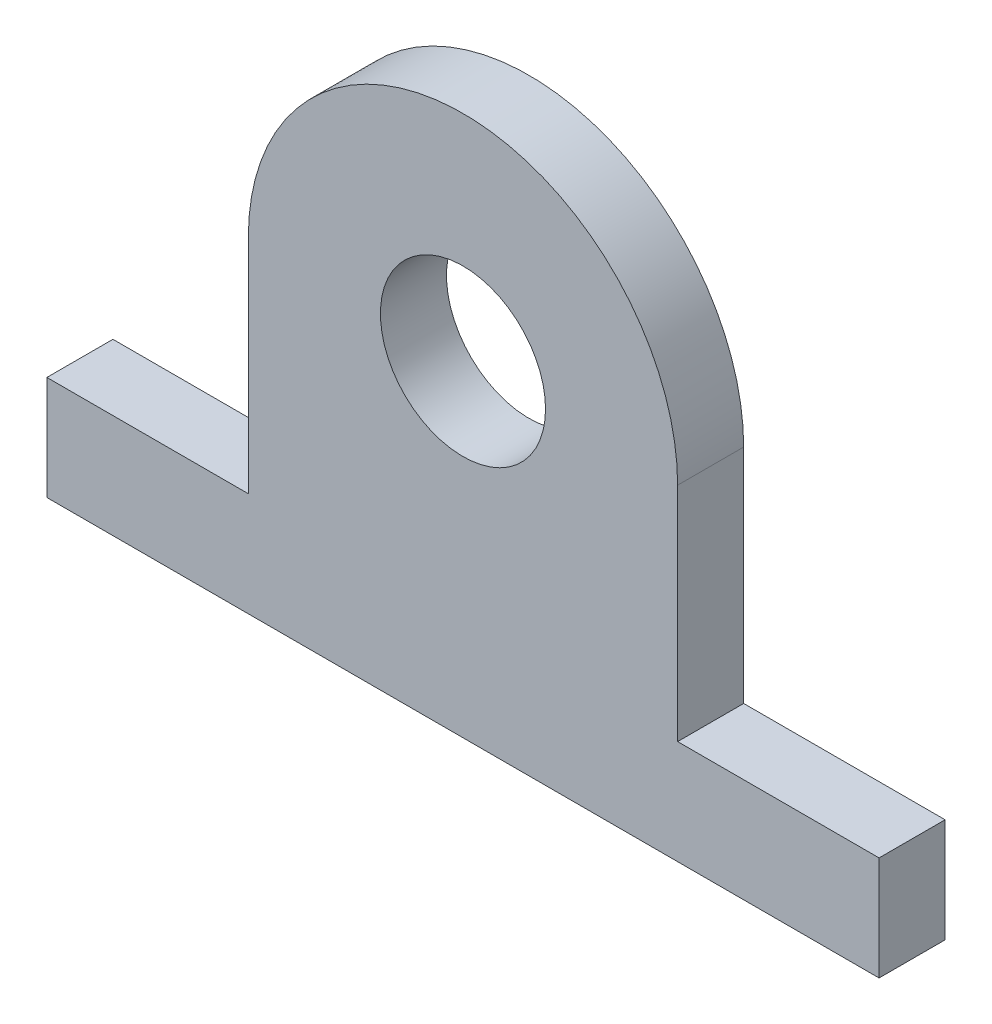
ISO-10303-21;
HEADER;
FILE_DESCRIPTION(('STEP AP214'),'2;1');
FILE_NAME('part.step','',(''),(''),'','','');
FILE_SCHEMA(('AUTOMOTIVE_DESIGN { 1 0 10303 214 1 1 1 1 }'));
ENDSEC;
DATA;
#1=APPLICATION_CONTEXT('core data for automotive mechanical design processes');
#2=APPLICATION_PROTOCOL_DEFINITION('international standard','automotive_design',2000,#1);
#3=PRODUCT_CONTEXT('',#1,'mechanical');
#4=PRODUCT('Part','Part','',(#3));
#5=PRODUCT_RELATED_PRODUCT_CATEGORY('part','',(#4));
#6=PRODUCT_DEFINITION_FORMATION('','',#4);
#7=PRODUCT_DEFINITION_CONTEXT('part definition',#1,'design');
#8=PRODUCT_DEFINITION('design','',#6,#7);
#9=PRODUCT_DEFINITION_SHAPE('','',#8);
#10=(LENGTH_UNIT() NAMED_UNIT(*) SI_UNIT(.MILLI.,.METRE.));
#11=(NAMED_UNIT(*) PLANE_ANGLE_UNIT() SI_UNIT($,.RADIAN.));
#12=(NAMED_UNIT(*) SI_UNIT($,.STERADIAN.) SOLID_ANGLE_UNIT());
#13=UNCERTAINTY_MEASURE_WITH_UNIT(LENGTH_MEASURE(1.E-05),#10,'distance_accuracy_value','');
#14=(GEOMETRIC_REPRESENTATION_CONTEXT(3) GLOBAL_UNCERTAINTY_ASSIGNED_CONTEXT((#13)) GLOBAL_UNIT_ASSIGNED_CONTEXT((#10,
#11,#12)) REPRESENTATION_CONTEXT('',''));
#15=CARTESIAN_POINT('',(0.,0.,0.));
#16=DIRECTION('',(0.,0.,1.));
#17=DIRECTION('',(1.,0.,0.));
#18=AXIS2_PLACEMENT_3D('',#15,#16,#17);
#19=CARTESIAN_POINT('',(0.,0.,6.35));
#20=DIRECTION('',(0.,0.,1.));
#21=DIRECTION('',(1.,0.,0.));
#22=AXIS2_PLACEMENT_3D('',#19,#20,#21);
#23=PLANE('',#22);
#24=DIRECTION('',(-1.,0.,0.));
#25=VECTOR('',#24,1.);
#26=CARTESIAN_POINT('',(20.6375,-21.35,6.35));
#27=LINE('',#26,#25);
#28=CARTESIAN_POINT('',(40.005,-21.35,6.35));
#29=VERTEX_POINT('',#28);
#30=CARTESIAN_POINT('',(20.6375,-21.35,6.35));
#31=VERTEX_POINT('',#30);
#32=EDGE_CURVE('E145',#29,#31,#27,.T.);
#33=ORIENTED_EDGE('',*,*,#32,.T.);
#34=DIRECTION('',(0.,1.,0.));
#35=VECTOR('',#34,1.);
#36=CARTESIAN_POINT('',(20.6375,0.,6.35));
#37=LINE('',#36,#35);
#38=CARTESIAN_POINT('',(20.6375,0.,6.35));
#39=VERTEX_POINT('',#38);
#40=EDGE_CURVE('E93',#31,#39,#37,.T.);
#41=ORIENTED_EDGE('',*,*,#40,.T.);
#42=CARTESIAN_POINT('',(0.,0.,6.35));
#43=DIRECTION('',(0.,0.,1.));
#44=DIRECTION('',(1.,0.,0.));
#45=AXIS2_PLACEMENT_3D('',#42,#43,#44);
#46=CIRCLE('',#45,20.6375);
#47=CARTESIAN_POINT('',(-20.6375,0.,6.35));
#48=VERTEX_POINT('',#47);
#49=EDGE_CURVE('E160',#39,#48,#46,.T.);
#50=ORIENTED_EDGE('',*,*,#49,.T.);
#51=DIRECTION('',(0.,-1.,0.));
#52=VECTOR('',#51,1.);
#53=CARTESIAN_POINT('',(-20.6375,0.,6.35));
#54=LINE('',#53,#52);
#55=CARTESIAN_POINT('',(-20.6375,-21.35,6.35));
#56=VERTEX_POINT('',#55);
#57=EDGE_CURVE('E173',#48,#56,#54,.T.);
#58=ORIENTED_EDGE('',*,*,#57,.T.);
#59=DIRECTION('',(-1.,0.,0.));
#60=VECTOR('',#59,1.);
#61=CARTESIAN_POINT('',(-40.005,-21.35,6.35));
#62=LINE('',#61,#60);
#63=CARTESIAN_POINT('',(-40.005,-21.35,6.35));
#64=VERTEX_POINT('',#63);
#65=EDGE_CURVE('E112',#56,#64,#62,.T.);
#66=ORIENTED_EDGE('',*,*,#65,.T.);
#67=DIRECTION('',(0.,-1.,0.));
#68=VECTOR('',#67,1.);
#69=CARTESIAN_POINT('',(-40.005,-31.35,6.35));
#70=LINE('',#69,#68);
#71=CARTESIAN_POINT('',(-40.005,-31.35,6.35));
#72=VERTEX_POINT('',#71);
#73=EDGE_CURVE('E106',#64,#72,#70,.T.);
#74=ORIENTED_EDGE('',*,*,#73,.T.);
#75=DIRECTION('',(1.,0.,0.));
#76=VECTOR('',#75,1.);
#77=CARTESIAN_POINT('',(-40.005,-31.35,6.35));
#78=LINE('',#77,#76);
#79=CARTESIAN_POINT('',(40.005,-31.35,6.35));
#80=VERTEX_POINT('',#79);
#81=EDGE_CURVE('E110',#72,#80,#78,.T.);
#82=ORIENTED_EDGE('',*,*,#81,.T.);
#83=DIRECTION('',(0.,1.,0.));
#84=VECTOR('',#83,1.);
#85=CARTESIAN_POINT('',(40.005,-31.35,6.35));
#86=LINE('',#85,#84);
#87=EDGE_CURVE('E50',#80,#29,#86,.T.);
#88=ORIENTED_EDGE('',*,*,#87,.T.);
#89=EDGE_LOOP('',(#33,#41,#50,#58,#66,#74,#82,#88));
#90=FACE_BOUND('',#89,.T.);
#91=CARTESIAN_POINT('',(0.,0.,6.35));
#92=DIRECTION('',(0.,0.,1.));
#93=DIRECTION('',(1.,0.,0.));
#94=AXIS2_PLACEMENT_3D('',#91,#92,#93);
#95=CIRCLE('',#94,7.9375);
#96=CARTESIAN_POINT('',(7.9375,0.,6.35));
#97=VERTEX_POINT('',#96);
#98=EDGE_CURVE('E134',#97,#97,#95,.T.);
#99=ORIENTED_EDGE('',*,*,#98,.F.);
#100=EDGE_LOOP('',(#99));
#101=FACE_BOUND('',#100,.T.);
#102=ADVANCED_FACE('F33',(#90,#101),#23,.T.);
#103=CARTESIAN_POINT('',(0.,0.,0.));
#104=DIRECTION('',(0.,0.,1.));
#105=DIRECTION('',(1.,0.,0.));
#106=AXIS2_PLACEMENT_3D('',#103,#104,#105);
#107=PLANE('',#106);
#108=DIRECTION('',(-1.,0.,0.));
#109=VECTOR('',#108,1.);
#110=CARTESIAN_POINT('',(20.6375,-21.35,0.));
#111=LINE('',#110,#109);
#112=CARTESIAN_POINT('',(40.005,-21.35,0.));
#113=VERTEX_POINT('',#112);
#114=CARTESIAN_POINT('',(20.6375,-21.35,0.));
#115=VERTEX_POINT('',#114);
#116=EDGE_CURVE('E130',#113,#115,#111,.T.);
#117=ORIENTED_EDGE('',*,*,#116,.F.);
#118=DIRECTION('',(0.,1.,0.));
#119=VECTOR('',#118,1.);
#120=CARTESIAN_POINT('',(40.005,-31.35,0.));
#121=LINE('',#120,#119);
#122=CARTESIAN_POINT('',(40.005,-31.35,0.));
#123=VERTEX_POINT('',#122);
#124=EDGE_CURVE('E85',#123,#113,#121,.T.);
#125=ORIENTED_EDGE('',*,*,#124,.F.);
#126=DIRECTION('',(1.,0.,0.));
#127=VECTOR('',#126,1.);
#128=CARTESIAN_POINT('',(-40.005,-31.35,0.));
#129=LINE('',#128,#127);
#130=CARTESIAN_POINT('',(-40.005,-31.35,0.));
#131=VERTEX_POINT('',#130);
#132=EDGE_CURVE('E79',#131,#123,#129,.T.);
#133=ORIENTED_EDGE('',*,*,#132,.F.);
#134=DIRECTION('',(0.,-1.,0.));
#135=VECTOR('',#134,1.);
#136=CARTESIAN_POINT('',(-40.005,-31.35,0.));
#137=LINE('',#136,#135);
#138=CARTESIAN_POINT('',(-40.005,-21.35,0.));
#139=VERTEX_POINT('',#138);
#140=EDGE_CURVE('E120',#139,#131,#137,.T.);
#141=ORIENTED_EDGE('',*,*,#140,.F.);
#142=DIRECTION('',(-1.,0.,0.));
#143=VECTOR('',#142,1.);
#144=CARTESIAN_POINT('',(-40.005,-21.35,0.));
#145=LINE('',#144,#143);
#146=CARTESIAN_POINT('',(-20.6375,-21.35,0.));
#147=VERTEX_POINT('',#146);
#148=EDGE_CURVE('E140',#147,#139,#145,.T.);
#149=ORIENTED_EDGE('',*,*,#148,.F.);
#150=DIRECTION('',(0.,-1.,0.));
#151=VECTOR('',#150,1.);
#152=CARTESIAN_POINT('',(-20.6375,0.,0.));
#153=LINE('',#152,#151);
#154=CARTESIAN_POINT('',(-20.6375,0.,0.));
#155=VERTEX_POINT('',#154);
#156=EDGE_CURVE('E138',#155,#147,#153,.T.);
#157=ORIENTED_EDGE('',*,*,#156,.F.);
#158=CARTESIAN_POINT('',(0.,0.,0.));
#159=DIRECTION('',(0.,0.,1.));
#160=DIRECTION('',(1.,0.,0.));
#161=AXIS2_PLACEMENT_3D('',#158,#159,#160);
#162=CIRCLE('',#161,20.6375);
#163=CARTESIAN_POINT('',(20.6375,0.,0.));
#164=VERTEX_POINT('',#163);
#165=EDGE_CURVE('E136',#164,#155,#162,.T.);
#166=ORIENTED_EDGE('',*,*,#165,.F.);
#167=DIRECTION('',(0.,1.,0.));
#168=VECTOR('',#167,1.);
#169=CARTESIAN_POINT('',(20.6375,0.,0.));
#170=LINE('',#169,#168);
#171=EDGE_CURVE('E133',#115,#164,#170,.T.);
#172=ORIENTED_EDGE('',*,*,#171,.F.);
#173=EDGE_LOOP('',(#117,#125,#133,#141,#149,#157,#166,#172));
#174=FACE_BOUND('',#173,.T.);
#175=CARTESIAN_POINT('',(0.,0.,0.));
#176=DIRECTION('',(0.,0.,1.));
#177=DIRECTION('',(1.,0.,0.));
#178=AXIS2_PLACEMENT_3D('',#175,#176,#177);
#179=CIRCLE('',#178,7.9375);
#180=CARTESIAN_POINT('',(7.9375,0.,0.));
#181=VERTEX_POINT('',#180);
#182=EDGE_CURVE('E179',#181,#181,#179,.T.);
#183=ORIENTED_EDGE('',*,*,#182,.T.);
#184=EDGE_LOOP('',(#183));
#185=FACE_BOUND('',#184,.T.);
#186=ADVANCED_FACE('F164',(#174,#185),#107,.F.);
#187=CARTESIAN_POINT('',(20.6375,-21.35,6.35));
#188=DIRECTION('',(0.,-1.,0.));
#189=DIRECTION('',(1.,0.,0.));
#190=AXIS2_PLACEMENT_3D('',#187,#188,#189);
#191=PLANE('',#190);
#192=ORIENTED_EDGE('',*,*,#116,.T.);
#193=DIRECTION('',(0.,0.,-1.));
#194=VECTOR('',#193,1.);
#195=CARTESIAN_POINT('',(20.6375,-21.35,6.35));
#196=LINE('',#195,#194);
#197=EDGE_CURVE('E11',#31,#115,#196,.T.);
#198=ORIENTED_EDGE('',*,*,#197,.F.);
#199=ORIENTED_EDGE('',*,*,#32,.F.);
#200=DIRECTION('',(0.,0.,-1.));
#201=VECTOR('',#200,1.);
#202=CARTESIAN_POINT('',(40.005,-21.35,6.35));
#203=LINE('',#202,#201);
#204=EDGE_CURVE('E126',#29,#113,#203,.T.);
#205=ORIENTED_EDGE('',*,*,#204,.T.);
#206=EDGE_LOOP('',(#192,#198,#199,#205));
#207=FACE_BOUND('',#206,.T.);
#208=ADVANCED_FACE('F35',(#207),#191,.F.);
#209=CARTESIAN_POINT('',(20.6375,0.,6.35));
#210=DIRECTION('',(-1.,0.,0.));
#211=DIRECTION('',(0.,-1.,0.));
#212=AXIS2_PLACEMENT_3D('',#209,#210,#211);
#213=PLANE('',#212);
#214=ORIENTED_EDGE('',*,*,#171,.T.);
#215=DIRECTION('',(0.,0.,-1.));
#216=VECTOR('',#215,1.);
#217=CARTESIAN_POINT('',(20.6375,0.,6.35));
#218=LINE('',#217,#216);
#219=EDGE_CURVE('E42',#39,#164,#218,.T.);
#220=ORIENTED_EDGE('',*,*,#219,.F.);
#221=ORIENTED_EDGE('',*,*,#40,.F.);
#222=ORIENTED_EDGE('',*,*,#197,.T.);
#223=EDGE_LOOP('',(#214,#220,#221,#222));
#224=FACE_BOUND('',#223,.T.);
#225=ADVANCED_FACE('F207',(#224),#213,.F.);
#226=CARTESIAN_POINT('',(0.,0.,6.35));
#227=DIRECTION('',(0.,0.,-1.));
#228=DIRECTION('',(-1.,0.,0.));
#229=AXIS2_PLACEMENT_3D('',#226,#227,#228);
#230=CYLINDRICAL_SURFACE('',#229,20.6375);
#231=ORIENTED_EDGE('',*,*,#165,.T.);
#232=DIRECTION('',(0.,0.,-1.));
#233=VECTOR('',#232,1.);
#234=CARTESIAN_POINT('',(-20.6375,0.,6.35));
#235=LINE('',#234,#233);
#236=EDGE_CURVE('E152',#48,#155,#235,.T.);
#237=ORIENTED_EDGE('',*,*,#236,.F.);
#238=ORIENTED_EDGE('',*,*,#49,.F.);
#239=ORIENTED_EDGE('',*,*,#219,.T.);
#240=EDGE_LOOP('',(#231,#237,#238,#239));
#241=FACE_BOUND('',#240,.T.);
#242=ADVANCED_FACE('F158',(#241),#230,.T.);
#243=CARTESIAN_POINT('',(-20.6375,0.,6.35));
#244=DIRECTION('',(1.,0.,0.));
#245=DIRECTION('',(0.,0.,-1.));
#246=AXIS2_PLACEMENT_3D('',#243,#244,#245);
#247=PLANE('',#246);
#248=ORIENTED_EDGE('',*,*,#156,.T.);
#249=DIRECTION('',(0.,0.,-1.));
#250=VECTOR('',#249,1.);
#251=CARTESIAN_POINT('',(-20.6375,-21.35,6.35));
#252=LINE('',#251,#250);
#253=EDGE_CURVE('E149',#56,#147,#252,.T.);
#254=ORIENTED_EDGE('',*,*,#253,.F.);
#255=ORIENTED_EDGE('',*,*,#57,.F.);
#256=ORIENTED_EDGE('',*,*,#236,.T.);
#257=EDGE_LOOP('',(#248,#254,#255,#256));
#258=FACE_BOUND('',#257,.T.);
#259=ADVANCED_FACE('F169',(#258),#247,.F.);
#260=CARTESIAN_POINT('',(-40.005,-21.35,6.35));
#261=DIRECTION('',(0.,-1.,0.));
#262=DIRECTION('',(0.,0.,-1.));
#263=AXIS2_PLACEMENT_3D('',#260,#261,#262);
#264=PLANE('',#263);
#265=ORIENTED_EDGE('',*,*,#148,.T.);
#266=DIRECTION('',(0.,0.,-1.));
#267=VECTOR('',#266,1.);
#268=CARTESIAN_POINT('',(-40.005,-21.35,6.35));
#269=LINE('',#268,#267);
#270=EDGE_CURVE('E121',#64,#139,#269,.T.);
#271=ORIENTED_EDGE('',*,*,#270,.F.);
#272=ORIENTED_EDGE('',*,*,#65,.F.);
#273=ORIENTED_EDGE('',*,*,#253,.T.);
#274=EDGE_LOOP('',(#265,#271,#272,#273));
#275=FACE_BOUND('',#274,.T.);
#276=ADVANCED_FACE('F172',(#275),#264,.F.);
#277=CARTESIAN_POINT('',(-40.005,-31.35,6.35));
#278=DIRECTION('',(1.,0.,0.));
#279=DIRECTION('',(0.,0.,-1.));
#280=AXIS2_PLACEMENT_3D('',#277,#278,#279);
#281=PLANE('',#280);
#282=ORIENTED_EDGE('',*,*,#140,.T.);
#283=DIRECTION('',(0.,0.,-1.));
#284=VECTOR('',#283,1.);
#285=CARTESIAN_POINT('',(-40.005,-31.35,6.35));
#286=LINE('',#285,#284);
#287=EDGE_CURVE('E117',#72,#131,#286,.T.);
#288=ORIENTED_EDGE('',*,*,#287,.F.);
#289=ORIENTED_EDGE('',*,*,#73,.F.);
#290=ORIENTED_EDGE('',*,*,#270,.T.);
#291=EDGE_LOOP('',(#282,#288,#289,#290));
#292=FACE_BOUND('',#291,.T.);
#293=ADVANCED_FACE('F118',(#292),#281,.F.);
#294=CARTESIAN_POINT('',(-40.005,-31.35,6.35));
#295=DIRECTION('',(0.,1.,0.));
#296=DIRECTION('',(0.,0.,1.));
#297=AXIS2_PLACEMENT_3D('',#294,#295,#296);
#298=PLANE('',#297);
#299=ORIENTED_EDGE('',*,*,#132,.T.);
#300=DIRECTION('',(0.,0.,-1.));
#301=VECTOR('',#300,1.);
#302=CARTESIAN_POINT('',(40.005,-31.35,6.35));
#303=LINE('',#302,#301);
#304=EDGE_CURVE('E122',#80,#123,#303,.T.);
#305=ORIENTED_EDGE('',*,*,#304,.F.);
#306=ORIENTED_EDGE('',*,*,#81,.F.);
#307=ORIENTED_EDGE('',*,*,#287,.T.);
#308=EDGE_LOOP('',(#299,#305,#306,#307));
#309=FACE_BOUND('',#308,.T.);
#310=ADVANCED_FACE('F124',(#309),#298,.F.);
#311=CARTESIAN_POINT('',(40.005,-31.35,6.35));
#312=DIRECTION('',(-1.,0.,0.));
#313=DIRECTION('',(0.,0.,1.));
#314=AXIS2_PLACEMENT_3D('',#311,#312,#313);
#315=PLANE('',#314);
#316=ORIENTED_EDGE('',*,*,#124,.T.);
#317=ORIENTED_EDGE('',*,*,#204,.F.);
#318=ORIENTED_EDGE('',*,*,#87,.F.);
#319=ORIENTED_EDGE('',*,*,#304,.T.);
#320=EDGE_LOOP('',(#316,#317,#318,#319));
#321=FACE_BOUND('',#320,.T.);
#322=ADVANCED_FACE('F195',(#321),#315,.F.);
#323=CARTESIAN_POINT('',(0.,0.,6.35));
#324=DIRECTION('',(0.,0.,-1.));
#325=DIRECTION('',(-1.,0.,0.));
#326=AXIS2_PLACEMENT_3D('',#323,#324,#325);
#327=CYLINDRICAL_SURFACE('',#326,7.9375);
#328=ORIENTED_EDGE('',*,*,#98,.T.);
#329=EDGE_LOOP('',(#328));
#330=FACE_BOUND('',#329,.T.);
#331=ORIENTED_EDGE('',*,*,#182,.F.);
#332=EDGE_LOOP('',(#331));
#333=FACE_BOUND('',#332,.T.);
#334=ADVANCED_FACE('F185',(#330,#333),#327,.F.);
#335=CLOSED_SHELL('',(#102,#186,#208,#225,#242,#259,#276,#293,#310,#322,#334));
#336=MANIFOLD_SOLID_BREP('B2',#335);
#337=ADVANCED_BREP_SHAPE_REPRESENTATION('',(#18,#336),#14);
#338=SHAPE_DEFINITION_REPRESENTATION(#9,#337);
ENDSEC;
END-ISO-10303-21;
